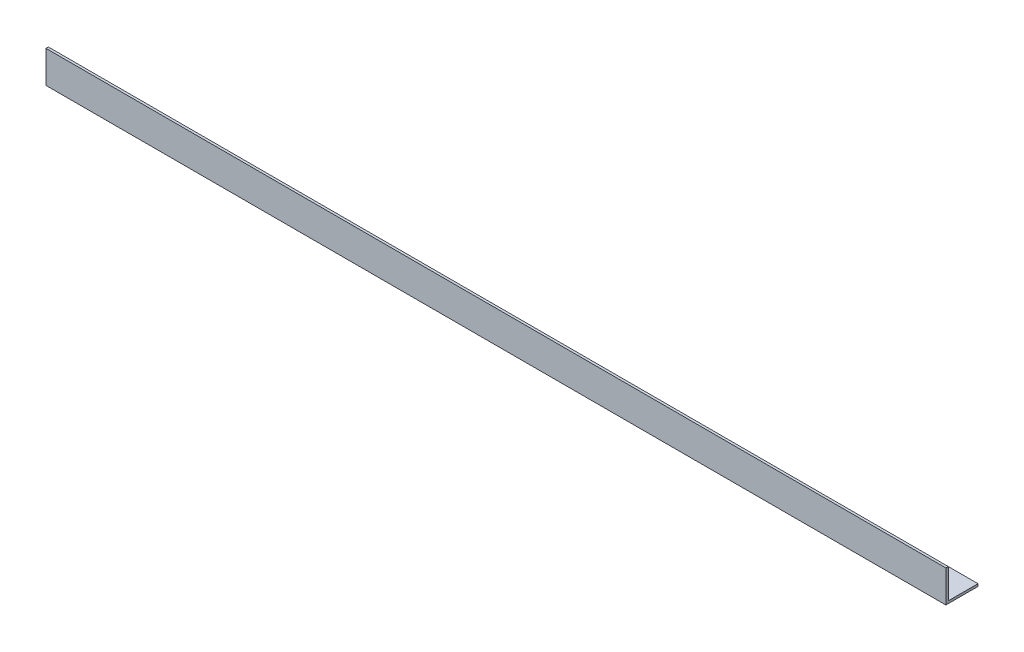
ISO-10303-21;
HEADER;
FILE_DESCRIPTION(('STEP AP214'),'2;1');
FILE_NAME('part.step','',(''),(''),'','','');
FILE_SCHEMA(('AUTOMOTIVE_DESIGN { 1 0 10303 214 1 1 1 1 }'));
ENDSEC;
DATA;
#1=APPLICATION_CONTEXT('core data for automotive mechanical design processes');
#2=APPLICATION_PROTOCOL_DEFINITION('international standard','automotive_design',2000,#1);
#3=PRODUCT_CONTEXT('',#1,'mechanical');
#4=PRODUCT('Part','Part','',(#3));
#5=PRODUCT_RELATED_PRODUCT_CATEGORY('part','',(#4));
#6=PRODUCT_DEFINITION_FORMATION('','',#4);
#7=PRODUCT_DEFINITION_CONTEXT('part definition',#1,'design');
#8=PRODUCT_DEFINITION('design','',#6,#7);
#9=PRODUCT_DEFINITION_SHAPE('','',#8);
#10=(LENGTH_UNIT() NAMED_UNIT(*) SI_UNIT(.MILLI.,.METRE.));
#11=(NAMED_UNIT(*) PLANE_ANGLE_UNIT() SI_UNIT($,.RADIAN.));
#12=(NAMED_UNIT(*) SI_UNIT($,.STERADIAN.) SOLID_ANGLE_UNIT());
#13=UNCERTAINTY_MEASURE_WITH_UNIT(LENGTH_MEASURE(1.E-05),#10,'distance_accuracy_value','');
#14=(GEOMETRIC_REPRESENTATION_CONTEXT(3) GLOBAL_UNCERTAINTY_ASSIGNED_CONTEXT((#13)) GLOBAL_UNIT_ASSIGNED_CONTEXT((#10,
#11,#12)) REPRESENTATION_CONTEXT('',''));
#15=CARTESIAN_POINT('',(0.,0.,0.));
#16=DIRECTION('',(0.,0.,1.));
#17=DIRECTION('',(1.,0.,0.));
#18=AXIS2_PLACEMENT_3D('',#15,#16,#17);
#19=CARTESIAN_POINT('',(1120.,0.,0.));
#20=DIRECTION('',(0.,1.,0.));
#21=DIRECTION('',(0.,0.,1.));
#22=AXIS2_PLACEMENT_3D('',#19,#20,#21);
#23=PLANE('',#22);
#24=DIRECTION('',(0.,0.,-1.));
#25=VECTOR('',#24,1.);
#26=CARTESIAN_POINT('',(0.,0.,0.));
#27=LINE('',#26,#25);
#28=CARTESIAN_POINT('',(0.,0.,0.));
#29=VERTEX_POINT('',#28);
#30=CARTESIAN_POINT('',(0.,0.,-40.));
#31=VERTEX_POINT('',#30);
#32=EDGE_CURVE('E118',#29,#31,#27,.T.);
#33=ORIENTED_EDGE('',*,*,#32,.T.);
#34=DIRECTION('',(-1.,0.,0.));
#35=VECTOR('',#34,1.);
#36=CARTESIAN_POINT('',(1120.,0.,-40.));
#37=LINE('',#36,#35);
#38=CARTESIAN_POINT('',(1120.,0.,-40.));
#39=VERTEX_POINT('',#38);
#40=EDGE_CURVE('E11',#39,#31,#37,.T.);
#41=ORIENTED_EDGE('',*,*,#40,.F.);
#42=DIRECTION('',(0.,0.,-1.));
#43=VECTOR('',#42,1.);
#44=CARTESIAN_POINT('',(1120.,0.,0.));
#45=LINE('',#44,#43);
#46=CARTESIAN_POINT('',(1120.,0.,0.));
#47=VERTEX_POINT('',#46);
#48=EDGE_CURVE('E83',#47,#39,#45,.T.);
#49=ORIENTED_EDGE('',*,*,#48,.F.);
#50=DIRECTION('',(-1.,0.,0.));
#51=VECTOR('',#50,1.);
#52=CARTESIAN_POINT('',(1120.,0.,0.));
#53=LINE('',#52,#51);
#54=EDGE_CURVE('E114',#47,#29,#53,.T.);
#55=ORIENTED_EDGE('',*,*,#54,.T.);
#56=EDGE_LOOP('',(#33,#41,#49,#55));
#57=FACE_BOUND('',#56,.T.);
#58=ADVANCED_FACE('F37',(#57),#23,.F.);
#59=CARTESIAN_POINT('',(1120.,3.,-40.));
#60=DIRECTION('',(0.,0.,-1.));
#61=DIRECTION('',(-1.,0.,0.));
#62=AXIS2_PLACEMENT_3D('',#59,#60,#61);
#63=PLANE('',#62);
#64=DIRECTION('',(0.,-1.,0.));
#65=VECTOR('',#64,1.);
#66=CARTESIAN_POINT('',(0.,3.,-40.));
#67=LINE('',#66,#65);
#68=CARTESIAN_POINT('',(0.,3.,-40.));
#69=VERTEX_POINT('',#68);
#70=EDGE_CURVE('E121',#69,#31,#67,.T.);
#71=ORIENTED_EDGE('',*,*,#70,.F.);
#72=DIRECTION('',(-1.,0.,0.));
#73=VECTOR('',#72,1.);
#74=CARTESIAN_POINT('',(1120.,3.,-40.));
#75=LINE('',#74,#73);
#76=CARTESIAN_POINT('',(1120.,3.,-40.));
#77=VERTEX_POINT('',#76);
#78=EDGE_CURVE('E45',#77,#69,#75,.T.);
#79=ORIENTED_EDGE('',*,*,#78,.F.);
#80=DIRECTION('',(0.,-1.,0.));
#81=VECTOR('',#80,1.);
#82=CARTESIAN_POINT('',(1120.,3.,-40.));
#83=LINE('',#82,#81);
#84=EDGE_CURVE('E223',#77,#39,#83,.T.);
#85=ORIENTED_EDGE('',*,*,#84,.T.);
#86=ORIENTED_EDGE('',*,*,#40,.T.);
#87=EDGE_LOOP('',(#71,#79,#85,#86));
#88=FACE_BOUND('',#87,.T.);
#89=ADVANCED_FACE('F139',(#88),#63,.T.);
#90=CARTESIAN_POINT('',(1120.,3.,0.));
#91=DIRECTION('',(0.,1.,0.));
#92=DIRECTION('',(0.,0.,1.));
#93=AXIS2_PLACEMENT_3D('',#90,#91,#92);
#94=PLANE('',#93);
#95=DIRECTION('',(0.,0.,-1.));
#96=VECTOR('',#95,1.);
#97=CARTESIAN_POINT('',(0.,3.,0.));
#98=LINE('',#97,#96);
#99=CARTESIAN_POINT('',(0.,3.,-3.));
#100=VERTEX_POINT('',#99);
#101=EDGE_CURVE('E124',#100,#69,#98,.T.);
#102=ORIENTED_EDGE('',*,*,#101,.F.);
#103=DIRECTION('',(-1.,0.,0.));
#104=VECTOR('',#103,1.);
#105=CARTESIAN_POINT('',(1120.,3.,-3.));
#106=LINE('',#105,#104);
#107=CARTESIAN_POINT('',(1120.,3.,-3.));
#108=VERTEX_POINT('',#107);
#109=EDGE_CURVE('E104',#108,#100,#106,.T.);
#110=ORIENTED_EDGE('',*,*,#109,.F.);
#111=DIRECTION('',(0.,0.,-1.));
#112=VECTOR('',#111,1.);
#113=CARTESIAN_POINT('',(1120.,3.,0.));
#114=LINE('',#113,#112);
#115=EDGE_CURVE('E110',#108,#77,#114,.T.);
#116=ORIENTED_EDGE('',*,*,#115,.T.);
#117=ORIENTED_EDGE('',*,*,#78,.T.);
#118=EDGE_LOOP('',(#102,#110,#116,#117));
#119=FACE_BOUND('',#118,.T.);
#120=ADVANCED_FACE('F136',(#119),#94,.T.);
#121=CARTESIAN_POINT('',(1120.,0.,-3.));
#122=DIRECTION('',(0.,0.,-1.));
#123=DIRECTION('',(-1.,0.,0.));
#124=AXIS2_PLACEMENT_3D('',#121,#122,#123);
#125=PLANE('',#124);
#126=DIRECTION('',(0.,1.,0.));
#127=VECTOR('',#126,1.);
#128=CARTESIAN_POINT('',(0.,0.,-3.));
#129=LINE('',#128,#127);
#130=CARTESIAN_POINT('',(0.,40.,-3.));
#131=VERTEX_POINT('',#130);
#132=EDGE_CURVE('E99',#131,#100,#129,.F.);
#133=ORIENTED_EDGE('',*,*,#132,.F.);
#134=DIRECTION('',(-1.,0.,0.));
#135=VECTOR('',#134,1.);
#136=CARTESIAN_POINT('',(1120.,40.,-3.));
#137=LINE('',#136,#135);
#138=CARTESIAN_POINT('',(1120.,40.,-3.));
#139=VERTEX_POINT('',#138);
#140=EDGE_CURVE('E94',#139,#131,#137,.T.);
#141=ORIENTED_EDGE('',*,*,#140,.F.);
#142=DIRECTION('',(0.,1.,0.));
#143=VECTOR('',#142,1.);
#144=CARTESIAN_POINT('',(1120.,0.,-3.));
#145=LINE('',#144,#143);
#146=EDGE_CURVE('E97',#139,#108,#145,.F.);
#147=ORIENTED_EDGE('',*,*,#146,.T.);
#148=ORIENTED_EDGE('',*,*,#109,.T.);
#149=EDGE_LOOP('',(#133,#141,#147,#148));
#150=FACE_BOUND('',#149,.T.);
#151=ADVANCED_FACE('F96',(#150),#125,.T.);
#152=CARTESIAN_POINT('',(1120.,40.,0.));
#153=DIRECTION('',(0.,1.,0.));
#154=DIRECTION('',(0.,0.,1.));
#155=AXIS2_PLACEMENT_3D('',#152,#153,#154);
#156=PLANE('',#155);
#157=DIRECTION('',(0.,0.,-1.));
#158=VECTOR('',#157,1.);
#159=CARTESIAN_POINT('',(0.,40.,0.));
#160=LINE('',#159,#158);
#161=CARTESIAN_POINT('',(0.,40.,0.));
#162=VERTEX_POINT('',#161);
#163=EDGE_CURVE('E128',#162,#131,#160,.T.);
#164=ORIENTED_EDGE('',*,*,#163,.F.);
#165=DIRECTION('',(-1.,0.,0.));
#166=VECTOR('',#165,1.);
#167=CARTESIAN_POINT('',(1120.,40.,0.));
#168=LINE('',#167,#166);
#169=CARTESIAN_POINT('',(1120.,40.,0.));
#170=VERTEX_POINT('',#169);
#171=EDGE_CURVE('E74',#170,#162,#168,.T.);
#172=ORIENTED_EDGE('',*,*,#171,.F.);
#173=DIRECTION('',(0.,0.,-1.));
#174=VECTOR('',#173,1.);
#175=CARTESIAN_POINT('',(1120.,40.,0.));
#176=LINE('',#175,#174);
#177=EDGE_CURVE('E108',#170,#139,#176,.T.);
#178=ORIENTED_EDGE('',*,*,#177,.T.);
#179=ORIENTED_EDGE('',*,*,#140,.T.);
#180=EDGE_LOOP('',(#164,#172,#178,#179));
#181=FACE_BOUND('',#180,.T.);
#182=ADVANCED_FACE('F112',(#181),#156,.T.);
#183=CARTESIAN_POINT('',(1120.,0.,0.));
#184=DIRECTION('',(0.,0.,-1.));
#185=DIRECTION('',(-1.,0.,0.));
#186=AXIS2_PLACEMENT_3D('',#183,#184,#185);
#187=PLANE('',#186);
#188=DIRECTION('',(0.,-1.,0.));
#189=VECTOR('',#188,1.);
#190=CARTESIAN_POINT('',(0.,0.,0.));
#191=LINE('',#190,#189);
#192=EDGE_CURVE('E77',#162,#29,#191,.T.);
#193=ORIENTED_EDGE('',*,*,#192,.T.);
#194=ORIENTED_EDGE('',*,*,#54,.F.);
#195=DIRECTION('',(0.,-1.,0.));
#196=VECTOR('',#195,1.);
#197=CARTESIAN_POINT('',(1120.,0.,0.));
#198=LINE('',#197,#196);
#199=EDGE_CURVE('E53',#170,#47,#198,.T.);
#200=ORIENTED_EDGE('',*,*,#199,.F.);
#201=ORIENTED_EDGE('',*,*,#171,.T.);
#202=EDGE_LOOP('',(#193,#194,#200,#201));
#203=FACE_BOUND('',#202,.T.);
#204=ADVANCED_FACE('F144',(#203),#187,.F.);
#205=CARTESIAN_POINT('',(1120.,0.,0.));
#206=DIRECTION('',(-1.,0.,0.));
#207=DIRECTION('',(0.,0.,1.));
#208=AXIS2_PLACEMENT_3D('',#205,#206,#207);
#209=PLANE('',#208);
#210=ORIENTED_EDGE('',*,*,#48,.T.);
#211=ORIENTED_EDGE('',*,*,#84,.F.);
#212=ORIENTED_EDGE('',*,*,#115,.F.);
#213=ORIENTED_EDGE('',*,*,#146,.F.);
#214=ORIENTED_EDGE('',*,*,#177,.F.);
#215=ORIENTED_EDGE('',*,*,#199,.T.);
#216=EDGE_LOOP('',(#210,#211,#212,#213,#214,#215));
#217=FACE_BOUND('',#216,.T.);
#218=ADVANCED_FACE('F107',(#217),#209,.F.);
#219=CARTESIAN_POINT('',(0.,0.,0.));
#220=DIRECTION('',(-1.,0.,0.));
#221=DIRECTION('',(0.,0.,1.));
#222=AXIS2_PLACEMENT_3D('',#219,#220,#221);
#223=PLANE('',#222);
#224=ORIENTED_EDGE('',*,*,#32,.F.);
#225=ORIENTED_EDGE('',*,*,#192,.F.);
#226=ORIENTED_EDGE('',*,*,#163,.T.);
#227=ORIENTED_EDGE('',*,*,#132,.T.);
#228=ORIENTED_EDGE('',*,*,#101,.T.);
#229=ORIENTED_EDGE('',*,*,#70,.T.);
#230=EDGE_LOOP('',(#224,#225,#226,#227,#228,#229));
#231=FACE_BOUND('',#230,.T.);
#232=ADVANCED_FACE('F142',(#231),#223,.T.);
#233=CLOSED_SHELL('',(#58,#89,#120,#151,#182,#204,#218,#232));
#234=MANIFOLD_SOLID_BREP('B2',#233);
#235=ADVANCED_BREP_SHAPE_REPRESENTATION('',(#18,#234),#14);
#236=SHAPE_DEFINITION_REPRESENTATION(#9,#235);
ENDSEC;
END-ISO-10303-21;
